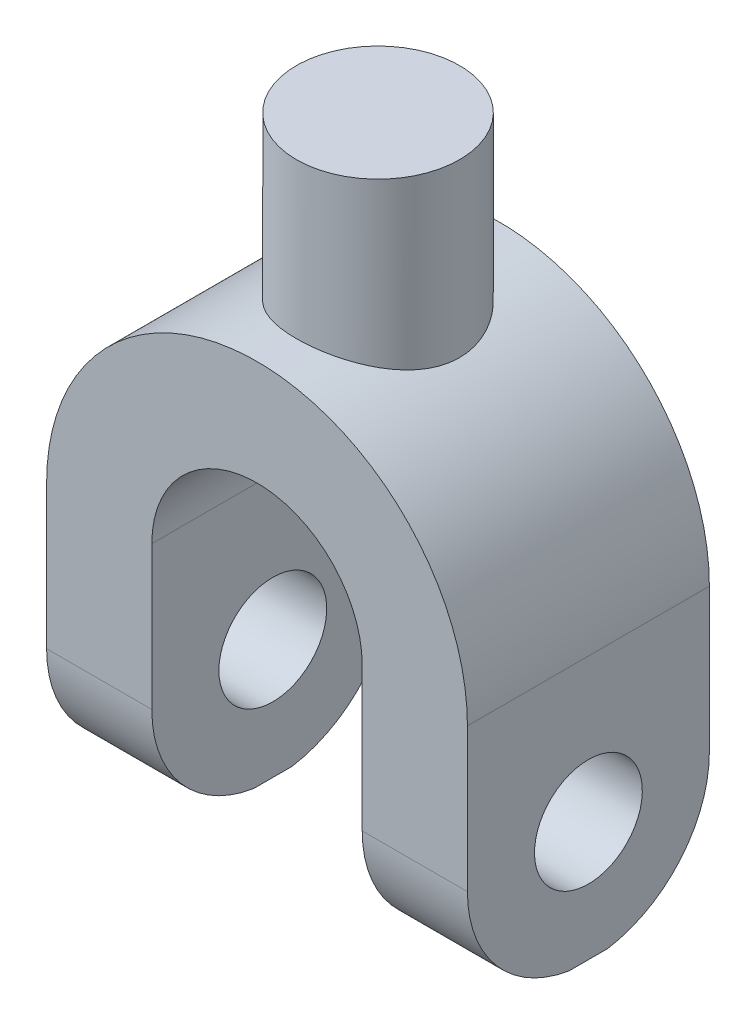
ISO-10303-21;
HEADER;
FILE_DESCRIPTION(('STEP AP214'),'2;1');
FILE_NAME('part.step','',(''),(''),'','','');
FILE_SCHEMA(('AUTOMOTIVE_DESIGN { 1 0 10303 214 1 1 1 1 }'));
ENDSEC;
DATA;
#1=APPLICATION_CONTEXT('core data for automotive mechanical design processes');
#2=APPLICATION_PROTOCOL_DEFINITION('international standard','automotive_design',2000,#1);
#3=PRODUCT_CONTEXT('',#1,'mechanical');
#4=PRODUCT('Part','Part','',(#3));
#5=PRODUCT_RELATED_PRODUCT_CATEGORY('part','',(#4));
#6=PRODUCT_DEFINITION_FORMATION('','',#4);
#7=PRODUCT_DEFINITION_CONTEXT('part definition',#1,'design');
#8=PRODUCT_DEFINITION('design','',#6,#7);
#9=PRODUCT_DEFINITION_SHAPE('','',#8);
#10=(LENGTH_UNIT() NAMED_UNIT(*) SI_UNIT(.MILLI.,.METRE.));
#11=(NAMED_UNIT(*) PLANE_ANGLE_UNIT() SI_UNIT($,.RADIAN.));
#12=(NAMED_UNIT(*) SI_UNIT($,.STERADIAN.) SOLID_ANGLE_UNIT());
#13=UNCERTAINTY_MEASURE_WITH_UNIT(LENGTH_MEASURE(1.E-05),#10,'distance_accuracy_value','');
#14=(GEOMETRIC_REPRESENTATION_CONTEXT(3) GLOBAL_UNCERTAINTY_ASSIGNED_CONTEXT((#13)) GLOBAL_UNIT_ASSIGNED_CONTEXT((#10,
#11,#12)) REPRESENTATION_CONTEXT('',''));
#15=CARTESIAN_POINT('',(0.,0.,0.));
#16=DIRECTION('',(0.,0.,1.));
#17=DIRECTION('',(1.,0.,0.));
#18=AXIS2_PLACEMENT_3D('',#15,#16,#17);
#19=CARTESIAN_POINT('',(-152.609053497942,0.,29.21));
#20=DIRECTION('',(1.,0.,0.));
#21=DIRECTION('',(0.,0.,-1.));
#22=AXIS2_PLACEMENT_3D('',#19,#20,#21);
#23=PLANE('',#22);
#24=CARTESIAN_POINT('',(-152.609053497942,-27.3983473015084,0.));
#25=DIRECTION('',(1.,0.,0.));
#26=DIRECTION('',(0.,1.,0.));
#27=AXIS2_PLACEMENT_3D('',#24,#25,#26);
#28=CIRCLE('',#27,13.0169015433458);
#29=CARTESIAN_POINT('',(-152.609053497942,-14.3814457581626,0.));
#30=VERTEX_POINT('',#29);
#31=EDGE_CURVE('E269',#30,#30,#28,.T.);
#32=ORIENTED_EDGE('',*,*,#31,.T.);
#33=EDGE_LOOP('',(#32));
#34=FACE_BOUND('',#33,.T.);
#35=CARTESIAN_POINT('',(-152.609053497942,-27.3983473015084,0.));
#36=DIRECTION('',(1.,0.,0.));
#37=DIRECTION('',(0.,1.,0.));
#38=AXIS2_PLACEMENT_3D('',#35,#36,#37);
#39=CIRCLE('',#38,29.21);
#40=CARTESIAN_POINT('',(-152.609053497942,-56.235390946502,-4.65285007460321));
#41=VERTEX_POINT('',#40);
#42=CARTESIAN_POINT('',(-152.609053497942,-27.3983473015084,-29.21));
#43=VERTEX_POINT('',#42);
#44=EDGE_CURVE('E322',#41,#43,#39,.T.);
#45=ORIENTED_EDGE('',*,*,#44,.F.);
#46=DIRECTION('',(0.,0.,-1.));
#47=VECTOR('',#46,1.);
#48=CARTESIAN_POINT('',(-152.609053497942,-56.235390946502,29.21));
#49=LINE('',#48,#47);
#50=CARTESIAN_POINT('',(-152.609053497942,-56.235390946502,4.65285007460321));
#51=VERTEX_POINT('',#50);
#52=EDGE_CURVE('E160',#51,#41,#49,.T.);
#53=ORIENTED_EDGE('',*,*,#52,.F.);
#54=CARTESIAN_POINT('',(-152.609053497942,-27.3983473015084,0.));
#55=DIRECTION('',(1.,0.,0.));
#56=DIRECTION('',(0.,1.,0.));
#57=AXIS2_PLACEMENT_3D('',#54,#55,#56);
#58=CIRCLE('',#57,29.21);
#59=CARTESIAN_POINT('',(-152.609053497942,-27.3983473015084,29.21));
#60=VERTEX_POINT('',#59);
#61=EDGE_CURVE('E146',#60,#51,#58,.T.);
#62=ORIENTED_EDGE('',*,*,#61,.F.);
#63=DIRECTION('',(0.,-1.,0.));
#64=VECTOR('',#63,1.);
#65=CARTESIAN_POINT('',(-152.609053497942,0.,29.21));
#66=LINE('',#65,#64);
#67=CARTESIAN_POINT('',(-152.609053497942,7.26460905349796,29.21));
#68=VERTEX_POINT('',#67);
#69=EDGE_CURVE('E157',#68,#60,#66,.T.);
#70=ORIENTED_EDGE('',*,*,#69,.F.);
#71=DIRECTION('',(0.,0.,-1.));
#72=VECTOR('',#71,1.);
#73=CARTESIAN_POINT('',(-152.609053497942,7.26460905349796,29.21));
#74=LINE('',#73,#72);
#75=CARTESIAN_POINT('',(-152.609053497942,7.26460905349796,-29.21));
#76=VERTEX_POINT('',#75);
#77=EDGE_CURVE('E213',#68,#76,#74,.T.);
#78=ORIENTED_EDGE('',*,*,#77,.T.);
#79=DIRECTION('',(0.,-1.,0.));
#80=VECTOR('',#79,1.);
#81=CARTESIAN_POINT('',(-152.609053497942,0.,-29.21));
#82=LINE('',#81,#80);
#83=EDGE_CURVE('E183',#76,#43,#82,.T.);
#84=ORIENTED_EDGE('',*,*,#83,.T.);
#85=EDGE_LOOP('',(#45,#53,#62,#70,#78,#84));
#86=FACE_BOUND('',#85,.T.);
#87=ADVANCED_FACE('F57',(#34,#86),#23,.F.);
#88=CARTESIAN_POINT('',(0.,-56.235390946502,29.21));
#89=DIRECTION('',(0.,1.,0.));
#90=DIRECTION('',(0.,0.,1.));
#91=AXIS2_PLACEMENT_3D('',#88,#89,#90);
#92=PLANE('',#91);
#93=DIRECTION('',(1.,0.,0.));
#94=VECTOR('',#93,1.);
#95=CARTESIAN_POINT('',(-152.609053497942,-56.235390946502,-4.65285007460321));
#96=LINE('',#95,#94);
#97=CARTESIAN_POINT('',(-127.209053497942,-56.235390946502,-4.65285007460321));
#98=VERTEX_POINT('',#97);
#99=EDGE_CURVE('E281',#41,#98,#96,.T.);
#100=ORIENTED_EDGE('',*,*,#99,.T.);
#101=DIRECTION('',(0.,0.,-1.));
#102=VECTOR('',#101,1.);
#103=CARTESIAN_POINT('',(-127.209053497942,-56.235390946502,29.21));
#104=LINE('',#103,#102);
#105=CARTESIAN_POINT('',(-127.209053497942,-56.235390946502,4.65285007460321));
#106=VERTEX_POINT('',#105);
#107=EDGE_CURVE('E209',#106,#98,#104,.T.);
#108=ORIENTED_EDGE('',*,*,#107,.F.);
#109=DIRECTION('',(1.,0.,0.));
#110=VECTOR('',#109,1.);
#111=CARTESIAN_POINT('',(-152.609053497942,-56.235390946502,4.65285007460321));
#112=LINE('',#111,#110);
#113=EDGE_CURVE('E278',#51,#106,#112,.T.);
#114=ORIENTED_EDGE('',*,*,#113,.F.);
#115=ORIENTED_EDGE('',*,*,#52,.T.);
#116=EDGE_LOOP('',(#100,#108,#114,#115));
#117=FACE_BOUND('',#116,.T.);
#118=ADVANCED_FACE('F259',(#117),#92,.F.);
#119=CARTESIAN_POINT('',(-127.209053497942,0.,29.21));
#120=DIRECTION('',(-1.,0.,0.));
#121=DIRECTION('',(0.,0.,1.));
#122=AXIS2_PLACEMENT_3D('',#119,#120,#121);
#123=PLANE('',#122);
#124=CARTESIAN_POINT('',(-127.209053497942,-27.3983473015084,0.));
#125=DIRECTION('',(-1.,0.,0.));
#126=DIRECTION('',(0.,0.,1.));
#127=AXIS2_PLACEMENT_3D('',#124,#125,#126);
#128=CIRCLE('',#127,13.0169015433458);
#129=CARTESIAN_POINT('',(-127.209053497942,-27.3983473015084,13.0169015433458));
#130=VERTEX_POINT('',#129);
#131=EDGE_CURVE('E292',#130,#130,#128,.T.);
#132=ORIENTED_EDGE('',*,*,#131,.T.);
#133=EDGE_LOOP('',(#132));
#134=FACE_BOUND('',#133,.T.);
#135=CARTESIAN_POINT('',(-127.209053497942,-27.3983473015084,0.));
#136=DIRECTION('',(-1.,0.,0.));
#137=DIRECTION('',(0.,0.,1.));
#138=AXIS2_PLACEMENT_3D('',#135,#136,#137);
#139=CIRCLE('',#138,29.21);
#140=CARTESIAN_POINT('',(-127.209053497942,-27.3983473015084,-29.21));
#141=VERTEX_POINT('',#140);
#142=EDGE_CURVE('E275',#141,#98,#139,.T.);
#143=ORIENTED_EDGE('',*,*,#142,.F.);
#144=DIRECTION('',(0.,1.,0.));
#145=VECTOR('',#144,1.);
#146=CARTESIAN_POINT('',(-127.209053497942,0.,-29.21));
#147=LINE('',#146,#145);
#148=CARTESIAN_POINT('',(-127.209053497942,7.26460905349796,-29.21));
#149=VERTEX_POINT('',#148);
#150=EDGE_CURVE('E187',#141,#149,#147,.T.);
#151=ORIENTED_EDGE('',*,*,#150,.T.);
#152=DIRECTION('',(0.,0.,-1.));
#153=VECTOR('',#152,1.);
#154=CARTESIAN_POINT('',(-127.209053497942,7.26460905349796,29.21));
#155=LINE('',#154,#153);
#156=CARTESIAN_POINT('',(-127.209053497942,7.26460905349796,29.21));
#157=VERTEX_POINT('',#156);
#158=EDGE_CURVE('E206',#157,#149,#155,.T.);
#159=ORIENTED_EDGE('',*,*,#158,.F.);
#160=DIRECTION('',(0.,1.,0.));
#161=VECTOR('',#160,1.);
#162=CARTESIAN_POINT('',(-127.209053497942,0.,29.21));
#163=LINE('',#162,#161);
#164=CARTESIAN_POINT('',(-127.209053497942,-27.3983473015084,29.21));
#165=VERTEX_POINT('',#164);
#166=EDGE_CURVE('E165',#165,#157,#163,.T.);
#167=ORIENTED_EDGE('',*,*,#166,.F.);
#168=CARTESIAN_POINT('',(-127.209053497942,-27.3983473015084,0.));
#169=DIRECTION('',(-1.,0.,0.));
#170=DIRECTION('',(0.,0.,1.));
#171=AXIS2_PLACEMENT_3D('',#168,#169,#170);
#172=CIRCLE('',#171,29.21);
#173=EDGE_CURVE('E80',#106,#165,#172,.T.);
#174=ORIENTED_EDGE('',*,*,#173,.F.);
#175=ORIENTED_EDGE('',*,*,#107,.T.);
#176=EDGE_LOOP('',(#143,#151,#159,#167,#174,#175));
#177=FACE_BOUND('',#176,.T.);
#178=ADVANCED_FACE('F252',(#134,#177),#123,.F.);
#179=CARTESIAN_POINT('',(-76.4090534979423,0.,29.21));
#180=DIRECTION('',(-1.,0.,0.));
#181=DIRECTION('',(0.,0.,1.));
#182=AXIS2_PLACEMENT_3D('',#179,#180,#181);
#183=PLANE('',#182);
#184=CARTESIAN_POINT('',(-76.4090534979423,-27.3983473015084,0.));
#185=DIRECTION('',(-1.,0.,0.));
#186=DIRECTION('',(0.,0.,1.));
#187=AXIS2_PLACEMENT_3D('',#184,#185,#186);
#188=CIRCLE('',#187,13.0169015433458);
#189=CARTESIAN_POINT('',(-76.4090534979423,-27.3983473015084,13.0169015433458));
#190=VERTEX_POINT('',#189);
#191=EDGE_CURVE('E289',#190,#190,#188,.T.);
#192=ORIENTED_EDGE('',*,*,#191,.F.);
#193=EDGE_LOOP('',(#192));
#194=FACE_BOUND('',#193,.T.);
#195=DIRECTION('',(0.,1.,0.));
#196=VECTOR('',#195,1.);
#197=CARTESIAN_POINT('',(-76.4090534979423,0.,-29.21));
#198=LINE('',#197,#196);
#199=CARTESIAN_POINT('',(-76.4090534979423,-27.3983473015084,-29.21));
#200=VERTEX_POINT('',#199);
#201=CARTESIAN_POINT('',(-76.4090534979423,7.26460905349796,-29.21));
#202=VERTEX_POINT('',#201);
#203=EDGE_CURVE('E192',#200,#202,#198,.T.);
#204=ORIENTED_EDGE('',*,*,#203,.F.);
#205=CARTESIAN_POINT('',(-76.4090534979423,-27.3983473015084,0.));
#206=DIRECTION('',(-1.,0.,0.));
#207=DIRECTION('',(0.,0.,1.));
#208=AXIS2_PLACEMENT_3D('',#205,#206,#207);
#209=CIRCLE('',#208,29.21);
#210=CARTESIAN_POINT('',(-76.4090534979423,-56.235390946502,-4.65285007460321));
#211=VERTEX_POINT('',#210);
#212=EDGE_CURVE('E271',#200,#211,#209,.T.);
#213=ORIENTED_EDGE('',*,*,#212,.T.);
#214=DIRECTION('',(0.,0.,-1.));
#215=VECTOR('',#214,1.);
#216=CARTESIAN_POINT('',(-76.4090534979423,-56.235390946502,29.21));
#217=LINE('',#216,#215);
#218=CARTESIAN_POINT('',(-76.4090534979423,-56.235390946502,4.65285007460321));
#219=VERTEX_POINT('',#218);
#220=EDGE_CURVE('E200',#219,#211,#217,.T.);
#221=ORIENTED_EDGE('',*,*,#220,.F.);
#222=CARTESIAN_POINT('',(-76.4090534979423,-27.3983473015084,0.));
#223=DIRECTION('',(-1.,0.,0.));
#224=DIRECTION('',(0.,0.,1.));
#225=AXIS2_PLACEMENT_3D('',#222,#223,#224);
#226=CIRCLE('',#225,29.21);
#227=CARTESIAN_POINT('',(-76.4090534979423,-27.3983473015084,29.21));
#228=VERTEX_POINT('',#227);
#229=EDGE_CURVE('E285',#219,#228,#226,.T.);
#230=ORIENTED_EDGE('',*,*,#229,.T.);
#231=DIRECTION('',(0.,1.,0.));
#232=VECTOR('',#231,1.);
#233=CARTESIAN_POINT('',(-76.4090534979423,0.,29.21));
#234=LINE('',#233,#232);
#235=CARTESIAN_POINT('',(-76.4090534979423,7.26460905349796,29.21));
#236=VERTEX_POINT('',#235);
#237=EDGE_CURVE('E175',#228,#236,#234,.T.);
#238=ORIENTED_EDGE('',*,*,#237,.T.);
#239=DIRECTION('',(0.,0.,-1.));
#240=VECTOR('',#239,1.);
#241=CARTESIAN_POINT('',(-76.4090534979423,7.26460905349796,29.21));
#242=LINE('',#241,#240);
#243=EDGE_CURVE('E203',#236,#202,#242,.T.);
#244=ORIENTED_EDGE('',*,*,#243,.T.);
#245=EDGE_LOOP('',(#204,#213,#221,#230,#238,#244));
#246=FACE_BOUND('',#245,.T.);
#247=ADVANCED_FACE('F248',(#194,#246),#183,.T.);
#248=CARTESIAN_POINT('',(0.,-56.235390946502,29.21));
#249=DIRECTION('',(0.,1.,0.));
#250=DIRECTION('',(0.,0.,1.));
#251=AXIS2_PLACEMENT_3D('',#248,#249,#250);
#252=PLANE('',#251);
#253=CARTESIAN_POINT('',(-51.0090534979424,-56.235390946502,-4.65285007460321));
#254=VERTEX_POINT('',#253);
#255=EDGE_CURVE('E336',#211,#254,#96,.T.);
#256=ORIENTED_EDGE('',*,*,#255,.T.);
#257=DIRECTION('',(0.,0.,-1.));
#258=VECTOR('',#257,1.);
#259=CARTESIAN_POINT('',(-51.0090534979424,-56.235390946502,29.21));
#260=LINE('',#259,#258);
#261=CARTESIAN_POINT('',(-51.0090534979424,-56.235390946502,4.65285007460321));
#262=VERTEX_POINT('',#261);
#263=EDGE_CURVE('E197',#262,#254,#260,.T.);
#264=ORIENTED_EDGE('',*,*,#263,.F.);
#265=EDGE_CURVE('E151',#219,#262,#112,.T.);
#266=ORIENTED_EDGE('',*,*,#265,.F.);
#267=ORIENTED_EDGE('',*,*,#220,.T.);
#268=EDGE_LOOP('',(#256,#264,#266,#267));
#269=FACE_BOUND('',#268,.T.);
#270=ADVANCED_FACE('F244',(#269),#252,.F.);
#271=CARTESIAN_POINT('',(-51.0090534979423,0.,29.21));
#272=DIRECTION('',(-1.,0.,0.));
#273=DIRECTION('',(0.,-1.,0.));
#274=AXIS2_PLACEMENT_3D('',#271,#272,#273);
#275=PLANE('',#274);
#276=CARTESIAN_POINT('',(-51.0090534979423,-27.3983473015085,0.));
#277=DIRECTION('',(1.,0.,0.));
#278=DIRECTION('',(0.,1.,0.));
#279=AXIS2_PLACEMENT_3D('',#276,#277,#278);
#280=CIRCLE('',#279,13.0169015433458);
#281=CARTESIAN_POINT('',(-51.0090534979423,-14.3814457581626,0.));
#282=VERTEX_POINT('',#281);
#283=EDGE_CURVE('E272',#282,#282,#280,.T.);
#284=ORIENTED_EDGE('',*,*,#283,.F.);
#285=EDGE_LOOP('',(#284));
#286=FACE_BOUND('',#285,.T.);
#287=CARTESIAN_POINT('',(-51.0090534979423,-27.3983473015085,0.));
#288=DIRECTION('',(1.,0.,0.));
#289=DIRECTION('',(0.,1.,0.));
#290=AXIS2_PLACEMENT_3D('',#287,#288,#289);
#291=CIRCLE('',#290,29.21);
#292=CARTESIAN_POINT('',(-51.0090534979423,-27.3983473015085,-29.21));
#293=VERTEX_POINT('',#292);
#294=EDGE_CURVE('E316',#254,#293,#291,.T.);
#295=ORIENTED_EDGE('',*,*,#294,.T.);
#296=DIRECTION('',(0.,1.,0.));
#297=VECTOR('',#296,1.);
#298=CARTESIAN_POINT('',(-51.0090534979423,0.,-29.21));
#299=LINE('',#298,#297);
#300=CARTESIAN_POINT('',(-51.0090534979423,7.26460905349796,-29.21));
#301=VERTEX_POINT('',#300);
#302=EDGE_CURVE('E169',#293,#301,#299,.T.);
#303=ORIENTED_EDGE('',*,*,#302,.T.);
#304=DIRECTION('',(0.,0.,-1.));
#305=VECTOR('',#304,1.);
#306=CARTESIAN_POINT('',(-51.0090534979423,7.26460905349796,29.21));
#307=LINE('',#306,#305);
#308=CARTESIAN_POINT('',(-51.0090534979423,7.26460905349796,29.21));
#309=VERTEX_POINT('',#308);
#310=EDGE_CURVE('E179',#309,#301,#307,.T.);
#311=ORIENTED_EDGE('',*,*,#310,.F.);
#312=DIRECTION('',(0.,1.,0.));
#313=VECTOR('',#312,1.);
#314=CARTESIAN_POINT('',(-51.0090534979423,0.,29.21));
#315=LINE('',#314,#313);
#316=CARTESIAN_POINT('',(-51.0090534979423,-27.3983473015085,29.21));
#317=VERTEX_POINT('',#316);
#318=EDGE_CURVE('E177',#317,#309,#315,.T.);
#319=ORIENTED_EDGE('',*,*,#318,.F.);
#320=CARTESIAN_POINT('',(-51.0090534979423,-27.3983473015085,0.));
#321=DIRECTION('',(1.,0.,0.));
#322=DIRECTION('',(0.,1.,0.));
#323=AXIS2_PLACEMENT_3D('',#320,#321,#322);
#324=CIRCLE('',#323,29.21);
#325=EDGE_CURVE('E73',#317,#262,#324,.T.);
#326=ORIENTED_EDGE('',*,*,#325,.T.);
#327=ORIENTED_EDGE('',*,*,#263,.T.);
#328=EDGE_LOOP('',(#295,#303,#311,#319,#326,#327));
#329=FACE_BOUND('',#328,.T.);
#330=ADVANCED_FACE('F238',(#286,#329),#275,.F.);
#331=CARTESIAN_POINT('',(0.,0.,29.21));
#332=DIRECTION('',(0.,0.,1.));
#333=DIRECTION('',(1.,0.,0.));
#334=AXIS2_PLACEMENT_3D('',#331,#332,#333);
#335=PLANE('',#334);
#336=ORIENTED_EDGE('',*,*,#69,.T.);
#337=DIRECTION('',(1.,0.,0.));
#338=VECTOR('',#337,1.);
#339=CARTESIAN_POINT('',(-152.609053497942,-27.3983473015084,29.21));
#340=LINE('',#339,#338);
#341=EDGE_CURVE('E143',#60,#165,#340,.T.);
#342=ORIENTED_EDGE('',*,*,#341,.T.);
#343=ORIENTED_EDGE('',*,*,#166,.T.);
#344=CARTESIAN_POINT('',(-101.809053497942,7.26460905349796,29.21));
#345=DIRECTION('',(0.,0.,1.));
#346=DIRECTION('',(1.,0.,0.));
#347=AXIS2_PLACEMENT_3D('',#344,#345,#346);
#348=CIRCLE('',#347,25.4);
#349=EDGE_CURVE('E167',#157,#236,#348,.F.);
#350=ORIENTED_EDGE('',*,*,#349,.T.);
#351=ORIENTED_EDGE('',*,*,#237,.F.);
#352=DIRECTION('',(1.,0.,0.));
#353=VECTOR('',#352,1.);
#354=CARTESIAN_POINT('',(-152.609053497942,-27.3983473015084,29.21));
#355=LINE('',#354,#353);
#356=EDGE_CURVE('E12',#228,#317,#355,.T.);
#357=ORIENTED_EDGE('',*,*,#356,.T.);
#358=ORIENTED_EDGE('',*,*,#318,.T.);
#359=CARTESIAN_POINT('',(-101.809053497942,7.26460905349796,29.21));
#360=DIRECTION('',(0.,0.,1.));
#361=DIRECTION('',(1.,0.,0.));
#362=AXIS2_PLACEMENT_3D('',#359,#360,#361);
#363=CIRCLE('',#362,50.8);
#364=EDGE_CURVE('E164',#68,#309,#363,.F.);
#365=ORIENTED_EDGE('',*,*,#364,.F.);
#366=EDGE_LOOP('',(#336,#342,#343,#350,#351,#357,#358,#365));
#367=FACE_BOUND('',#366,.T.);
#368=ADVANCED_FACE('F162',(#367),#335,.T.);
#369=CARTESIAN_POINT('',(0.,0.,-29.21));
#370=DIRECTION('',(0.,0.,1.));
#371=DIRECTION('',(1.,0.,0.));
#372=AXIS2_PLACEMENT_3D('',#369,#370,#371);
#373=PLANE('',#372);
#374=DIRECTION('',(1.,0.,0.));
#375=VECTOR('',#374,1.);
#376=CARTESIAN_POINT('',(-152.609053497942,-27.3983473015084,-29.21));
#377=LINE('',#376,#375);
#378=EDGE_CURVE('E340',#43,#141,#377,.T.);
#379=ORIENTED_EDGE('',*,*,#378,.F.);
#380=ORIENTED_EDGE('',*,*,#83,.F.);
#381=CARTESIAN_POINT('',(-101.809053497942,7.26460905349796,-29.21));
#382=DIRECTION('',(0.,0.,1.));
#383=DIRECTION('',(1.,0.,0.));
#384=AXIS2_PLACEMENT_3D('',#381,#382,#383);
#385=CIRCLE('',#384,50.8);
#386=EDGE_CURVE('E180',#76,#301,#385,.F.);
#387=ORIENTED_EDGE('',*,*,#386,.T.);
#388=ORIENTED_EDGE('',*,*,#302,.F.);
#389=DIRECTION('',(1.,0.,0.));
#390=VECTOR('',#389,1.);
#391=CARTESIAN_POINT('',(-152.609053497942,-27.3983473015084,-29.21));
#392=LINE('',#391,#390);
#393=EDGE_CURVE('E66',#200,#293,#392,.T.);
#394=ORIENTED_EDGE('',*,*,#393,.F.);
#395=ORIENTED_EDGE('',*,*,#203,.T.);
#396=CARTESIAN_POINT('',(-101.809053497942,7.26460905349796,-29.21));
#397=DIRECTION('',(0.,0.,1.));
#398=DIRECTION('',(1.,0.,0.));
#399=AXIS2_PLACEMENT_3D('',#396,#397,#398);
#400=CIRCLE('',#399,25.4);
#401=EDGE_CURVE('E189',#149,#202,#400,.F.);
#402=ORIENTED_EDGE('',*,*,#401,.F.);
#403=ORIENTED_EDGE('',*,*,#150,.F.);
#404=EDGE_LOOP('',(#379,#380,#387,#388,#394,#395,#402,#403));
#405=FACE_BOUND('',#404,.T.);
#406=ADVANCED_FACE('F237',(#405),#373,.F.);
#407=CARTESIAN_POINT('',(-101.809053497942,7.26460905349796,29.21));
#408=DIRECTION('',(0.,0.,-1.));
#409=DIRECTION('',(-1.,0.,0.));
#410=AXIS2_PLACEMENT_3D('',#407,#408,#409);
#411=CYLINDRICAL_SURFACE('',#410,50.8);
#412=ORIENTED_EDGE('',*,*,#386,.F.);
#413=ORIENTED_EDGE('',*,*,#77,.F.);
#414=ORIENTED_EDGE('',*,*,#364,.T.);
#415=ORIENTED_EDGE('',*,*,#310,.T.);
#416=EDGE_LOOP('',(#412,#413,#414,#415));
#417=FACE_BOUND('',#416,.T.);
#418=CARTESIAN_POINT('',(-101.809053497942,58.064609053498,19.6930949171975));
#419=CARTESIAN_POINT('',(-102.340980770365,58.0646115698917,19.6930982786585));
#420=CARTESIAN_POINT('',(-102.872863391504,58.0562367826779,19.6715271935733));
#421=CARTESIAN_POINT('',(-103.932584792658,58.0229732306218,19.5854824459213));
#422=CARTESIAN_POINT('',(-104.460424012044,57.9980862865575,19.521013513652));
#423=CARTESIAN_POINT('',(-105.508077663399,57.9324754379461,19.3498552326294));
#424=CARTESIAN_POINT('',(-106.027893792055,57.8917549308741,19.2431749412607));
#425=CARTESIAN_POINT('',(-107.055953139802,57.7955561171556,18.9886405680291));
#426=CARTESIAN_POINT('',(-107.564195976733,57.7400773239425,18.8407851286534));
#427=CARTESIAN_POINT('',(-108.564633026344,57.6159320431117,18.5056174511092));
#428=CARTESIAN_POINT('',(-109.056858323072,57.5472931313561,18.3183876403601));
#429=CARTESIAN_POINT('',(-110.02326760142,57.3984872084275,17.9058848895641));
#430=CARTESIAN_POINT('',(-110.497451749793,57.3183203038396,17.6806123012488));
#431=CARTESIAN_POINT('',(-111.425104349038,57.1484139983212,17.1937205633058));
#432=CARTESIAN_POINT('',(-111.878568166628,57.0586724712214,16.9320933367422));
#433=CARTESIAN_POINT('',(-112.762173909271,56.8717972088576,16.3743739626468));
#434=CARTESIAN_POINT('',(-113.192315074043,56.7746632328591,16.078280692565));
#435=CARTESIAN_POINT('',(-114.043816107547,56.5713005831376,15.440940798547));
#436=CARTESIAN_POINT('',(-114.464124931115,56.4648631891612,15.0983560772575));
#437=CARTESIAN_POINT('',(-115.274875027593,56.2491752868654,14.379956299357));
#438=CARTESIAN_POINT('',(-115.665302552561,56.1399235142225,14.0041261164003));
#439=CARTESIAN_POINT('',(-116.414009102598,55.9214422648378,13.2214460364139));
#440=CARTESIAN_POINT('',(-116.772277547587,55.8122128071436,12.814586011648));
#441=CARTESIAN_POINT('',(-117.454256091326,55.5967463112611,11.9724301088726));
#442=CARTESIAN_POINT('',(-117.777981222636,55.4905079863314,11.537146734171));
#443=CARTESIAN_POINT('',(-118.401720875709,55.2795679058546,10.6217111193631));
#444=CARTESIAN_POINT('',(-118.700188156346,55.1751140573828,10.1404455067893));
#445=CARTESIAN_POINT('',(-119.255309363536,54.9757732047187,9.1524433819463));
#446=CARTESIAN_POINT('',(-119.511961846628,54.8808865308316,8.64570599117229));
#447=CARTESIAN_POINT('',(-119.981148482727,54.7038108280061,7.61024939590851));
#448=CARTESIAN_POINT('',(-120.193697473171,54.6216175311089,7.0815376561832));
#449=CARTESIAN_POINT('',(-120.572700774847,54.4727339869875,6.00572358233141));
#450=CARTESIAN_POINT('',(-120.739158000867,54.4060427594741,5.45862241358499));
#451=CARTESIAN_POINT('',(-121.018017847621,54.2930828025416,4.37417916877285));
#452=CARTESIAN_POINT('',(-121.132445110723,54.246056234059,3.83743664732433));
#453=CARTESIAN_POINT('',(-121.316210689375,54.1700538205602,2.75501579747448));
#454=CARTESIAN_POINT('',(-121.385550232926,54.1410774839325,2.20933771285542));
#455=CARTESIAN_POINT('',(-121.478319190695,54.1022277789231,1.11362499805567));
#456=CARTESIAN_POINT('',(-121.501766382403,54.0923470134378,0.563592137736513));
#457=CARTESIAN_POINT('',(-121.502521129378,54.0920299714024,-0.536498909198987));
#458=CARTESIAN_POINT('',(-121.479830650319,54.1015928664637,-1.08655709373799));
#459=CARTESIAN_POINT('',(-121.39155008784,54.1385665504966,-2.14666255632285));
#460=CARTESIAN_POINT('',(-121.328833283243,54.1647814295023,-2.65699411598842));
#461=CARTESIAN_POINT('',(-121.163936445655,54.2330714678586,-3.67013375273247));
#462=CARTESIAN_POINT('',(-121.061758374744,54.2751458386468,-4.17294220258136));
#463=CARTESIAN_POINT('',(-120.818906754603,54.3738717001145,-5.16775342263859));
#464=CARTESIAN_POINT('',(-120.6782288131,54.4305248539758,-5.65975495301289));
#465=CARTESIAN_POINT('',(-120.359629353789,54.5567380258514,-6.62984113362931));
#466=CARTESIAN_POINT('',(-120.181706548092,54.6262984901768,-7.10792530197296));
#467=CARTESIAN_POINT('',(-119.786204750716,54.7778464575365,-8.05663130520746));
#468=CARTESIAN_POINT('',(-119.567915307231,54.8600512656447,-8.52692198032538));
#469=CARTESIAN_POINT('',(-119.095755938028,55.033564949058,-9.44751475950625));
#470=CARTESIAN_POINT('',(-118.841885841807,55.1248738679896,-9.8978167677694));
#471=CARTESIAN_POINT('',(-118.300195651662,55.3142140851054,-10.7762027635488));
#472=CARTESIAN_POINT('',(-118.012365678718,55.4122473359265,-11.2042802334779));
#473=CARTESIAN_POINT('',(-117.404556498229,55.6125424471549,-12.0359285167523));
#474=CARTESIAN_POINT('',(-117.084575734963,55.7148045120461,-12.4394981426882));
#475=CARTESIAN_POINT('',(-116.39000477393,55.9285301061839,-13.2483261754096));
#476=CARTESIAN_POINT('',(-116.013139207576,56.0401245225118,-13.6515988783417));
#477=CARTESIAN_POINT('',(-115.22673728681,56.2622895523497,-14.4252563487777));
#478=CARTESIAN_POINT('',(-114.817199424224,56.3728601183349,-14.795639596415));
#479=CARTESIAN_POINT('',(-113.967755031971,56.590040175793,-15.5012536203515));
#480=CARTESIAN_POINT('',(-113.527842950932,56.6966489376772,-15.8364779424462));
#481=CARTESIAN_POINT('',(-112.620285514776,56.9030397070617,-16.4694051477969));
#482=CARTESIAN_POINT('',(-112.152640316427,57.0028217531451,-16.7671082431222));
#483=CARTESIAN_POINT('',(-111.183961801943,57.1945508592657,-17.3276566681151));
#484=CARTESIAN_POINT('',(-110.682485292276,57.2863288329604,-17.5897951575538));
#485=CARTESIAN_POINT('',(-109.657042945385,57.4574294947751,-18.0706313868036));
#486=CARTESIAN_POINT('',(-109.133076650381,57.5367519292092,-18.2893282418498));
#487=CARTESIAN_POINT('',(-108.06660072771,57.6806032447948,-18.6811044805901));
#488=CARTESIAN_POINT('',(-107.524098327515,57.7451378179682,-18.8542014200808));
#489=CARTESIAN_POINT('',(-106.42452568558,57.857521005025,-19.153065882838));
#490=CARTESIAN_POINT('',(-105.867456385955,57.9053706951499,-19.278836458885));
#491=CARTESIAN_POINT('',(-104.774903350398,57.9807458943623,-19.4759419652275));
#492=CARTESIAN_POINT('',(-104.239967287464,58.0092629696198,-19.5499402276888));
#493=CARTESIAN_POINT('',(-103.165197931628,58.0493508315204,-19.6537603589608));
#494=CARTESIAN_POINT('',(-102.625364823065,58.0609222534091,-19.6835838837604));
#495=CARTESIAN_POINT('',(-101.545097004832,58.0667943865242,-19.6987326278232));
#496=CARTESIAN_POINT('',(-101.00466244519,58.061098721698,-19.6840671842534));
#497=CARTESIAN_POINT('',(-99.9272837472406,58.032604025051,-19.6104170318484));
#498=CARTESIAN_POINT('',(-99.3903395492969,58.0098052862312,-19.5514330822546));
#499=CARTESIAN_POINT('',(-98.3463117764404,57.9490385180293,-19.3931548805792));
#500=CARTESIAN_POINT('',(-97.8389169945559,57.9117430288296,-19.2956450256647));
#501=CARTESIAN_POINT('',(-96.8345481205591,57.8229758260262,-19.0614316525211));
#502=CARTESIAN_POINT('',(-96.3375736646182,57.771504608262,-18.9247295051555));
#503=CARTESIAN_POINT('',(-95.3571940414213,57.6556519330713,-18.6133302458635));
#504=CARTESIAN_POINT('',(-94.8737899709999,57.5912694354883,-18.4386300726499));
#505=CARTESIAN_POINT('',(-93.9235063025793,57.4511496430054,-18.0526773745527));
#506=CARTESIAN_POINT('',(-93.456627264783,57.3754119636167,-17.8414236119199));
#507=CARTESIAN_POINT('',(-92.5283118668966,57.2119471711541,-17.3770882332062));
#508=CARTESIAN_POINT('',(-92.0674600568254,57.123928299146,-17.1229409707121));
#509=CARTESIAN_POINT('',(-91.1687175165727,56.9398915954622,-16.5794165534809));
#510=CARTESIAN_POINT('',(-90.7308271034854,56.8438736533674,-16.2900389123995));
#511=CARTESIAN_POINT('',(-89.8802872513128,56.6461361321829,-15.6779175330789));
#512=CARTESIAN_POINT('',(-89.4676419908905,56.5444156144947,-15.3551682947158));
#513=CARTESIAN_POINT('',(-88.6696870089628,56.3376873142876,-14.678178212749));
#514=CARTESIAN_POINT('',(-88.2843871183087,56.232678368914,-14.3239261457451));
#515=CARTESIAN_POINT('',(-87.5203272829932,56.0154005680263,-13.5631351549359));
#516=CARTESIAN_POINT('',(-87.1434494864602,55.9030847839452,-13.1547168741522));
#517=CARTESIAN_POINT('',(-86.425249570138,55.680721480991,-12.3071179413454));
#518=CARTESIAN_POINT('',(-86.0839294714371,55.5706740913376,-11.8679355430699));
#519=CARTESIAN_POINT('',(-85.4389852773748,55.3559435387447,-10.9612252896215));
#520=CARTESIAN_POINT('',(-85.1353739546434,55.2512622003945,-10.4936879094882));
#521=CARTESIAN_POINT('',(-84.5682946488932,55.0504512721263,-9.53336425161374));
#522=CARTESIAN_POINT('',(-84.3048105535164,54.9543182562713,-9.04058821477105));
#523=CARTESIAN_POINT('',(-83.8182655395652,54.7729186601824,-8.02911436182666));
#524=CARTESIAN_POINT('',(-83.5955027928969,54.6877334920371,-7.51025824953981));
#525=CARTESIAN_POINT('',(-83.1947770999475,54.5318809119373,-6.45337668335272));
#526=CARTESIAN_POINT('',(-83.0168146548753,54.4612136624053,-5.91535101506764));
#527=CARTESIAN_POINT('',(-82.7076344704315,54.3369319506467,-4.82441820876588));
#528=CARTESIAN_POINT('',(-82.5763902560333,54.2833078320007,-4.27151969082894));
#529=CARTESIAN_POINT('',(-82.3620200347812,54.1950511058315,-3.15498773091614));
#530=CARTESIAN_POINT('',(-82.2788903425175,54.1604170437447,-2.59135511455278));
#531=CARTESIAN_POINT('',(-82.1657518858865,54.1131325387105,-1.49681196482359));
#532=CARTESIAN_POINT('',(-82.1325068383105,54.0991438662376,-0.966291473281656));
#533=CARTESIAN_POINT('',(-82.1090297903166,54.0892740351885,0.0958572214212467));
#534=CARTESIAN_POINT('',(-82.1187957478388,54.0933920169516,0.627485370795448));
#535=CARTESIAN_POINT('',(-82.1812258468664,54.1195928823188,1.6877057780178));
#536=CARTESIAN_POINT('',(-82.2338855753245,54.1416739178267,2.21629834254281));
#537=CARTESIAN_POINT('',(-82.3815205383478,54.2030510306746,3.26651786482444));
#538=CARTESIAN_POINT('',(-82.4764956675071,54.2423470651328,3.7881448399287));
#539=CARTESIAN_POINT('',(-82.7037195541036,54.3352016969574,4.80259233059231));
#540=CARTESIAN_POINT('',(-82.8345486800966,54.3882134666939,5.29578230513904));
#541=CARTESIAN_POINT('',(-83.1335031315458,54.507488863416,6.26904775389773));
#542=CARTESIAN_POINT('',(-83.3016272862945,54.5737520744266,6.7491236392356));
#543=CARTESIAN_POINT('',(-83.6738245703047,54.7176727646378,7.69344448546876));
#544=CARTESIAN_POINT('',(-83.8779039830158,54.7953322350227,8.15768666235197));
#545=CARTESIAN_POINT('',(-84.3204935064408,54.9599546688367,9.06776335084192));
#546=CARTESIAN_POINT('',(-84.559006474354,55.0469184041522,9.51359633095358));
#547=CARTESIAN_POINT('',(-85.0828785757526,55.2328953153237,10.4084783249619));
#548=CARTESIAN_POINT('',(-85.3700907229019,55.3323079006966,10.8563600662752));
#549=CARTESIAN_POINT('',(-85.9791572663126,55.5363140782744,11.7266576257915));
#550=CARTESIAN_POINT('',(-86.3010126373507,55.6409078162198,12.1490727269028));
#551=CARTESIAN_POINT('',(-86.9775272763334,55.852585512508,12.9663133732086));
#552=CARTESIAN_POINT('',(-87.332196298989,55.9596702042238,13.3611306526028));
#553=CARTESIAN_POINT('',(-88.0722582073709,56.1735939931387,14.120895525817));
#554=CARTESIAN_POINT('',(-88.4576510763694,56.2804330904715,14.4858431358995));
#555=CARTESIAN_POINT('',(-89.2809085014763,56.4974981069889,15.2045925114176));
#556=CARTESIAN_POINT('',(-89.7205308834663,56.6075470963569,15.55643787287));
#557=CARTESIAN_POINT('',(-90.6293090197085,56.8213562806264,16.2218518258195));
#558=CARTESIAN_POINT('',(-91.0984655040832,56.925116319932,16.5354194704769));
#559=CARTESIAN_POINT('',(-92.0635210748045,57.1234825003792,17.1219584303298));
#560=CARTESIAN_POINT('',(-92.5594261418734,57.2180865810144,17.3949206148419));
#561=CARTESIAN_POINT('',(-93.5746429051034,57.3954380730197,17.897860044571));
#562=CARTESIAN_POINT('',(-94.0939555250245,57.4781850159181,18.127835591509));
#563=CARTESIAN_POINT('',(-95.1907887983249,57.6349095129995,18.5576977001444));
#564=CARTESIAN_POINT('',(-95.7697989749671,57.7078152289643,18.7541905837475));
#565=CARTESIAN_POINT('',(-96.945570090972,57.8347203447362,19.0928998632438));
#566=CARTESIAN_POINT('',(-97.5423324404621,57.8887182382438,19.2351119349148));
#567=CARTESIAN_POINT('',(-98.7477082954876,57.9758808815358,19.4633556660473));
#568=CARTESIAN_POINT('',(-99.3563157082269,58.0090560644835,19.5494154613122));
#569=CARTESIAN_POINT('',(-100.579653758759,58.0534170049624,19.6642787401318));
#570=CARTESIAN_POINT('',(-101.194383439832,58.0646061456721,19.6930910328518));
#571=CARTESIAN_POINT('',(-101.809053497942,58.064609053498,19.6930949171975));
#572=B_SPLINE_CURVE_WITH_KNOTS('',3,(#418,#419,#420,#421,#422,#423,#424,#425,#426,#427,#428,
#429,#430,#431,#432,#433,#434,#435,#436,#437,#438,#439,#440,#441,#442,#443,#444,#445,#446,#447,
#448,#449,#450,#451,#452,#453,#454,#455,#456,#457,#458,#459,#460,#461,#462,#463,#464,#465,#466,
#467,#468,#469,#470,#471,#472,#473,#474,#475,#476,#477,#478,#479,#480,#481,#482,#483,#484,#485,
#486,#487,#488,#489,#490,#491,#492,#493,#494,#495,#496,#497,#498,#499,#500,#501,#502,#503,#504,
#505,#506,#507,#508,#509,#510,#511,#512,#513,#514,#515,#516,#517,#518,#519,#520,#521,#522,#523,
#524,#525,#526,#527,#528,#529,#530,#531,#532,#533,#534,#535,#536,#537,#538,#539,#540,#541,#542,
#543,#544,#545,#546,#547,#548,#549,#550,#551,#552,#553,#554,#555,#556,#557,#558,#559,#560,#561,
#562,#563,#564,#565,#566,#567,#568,#569,#570,#571),.UNSPECIFIED.,.T.,.F.,(4,2,2,2,2,2,2,2,2,2,2,
2,2,2,2,2,2,2,2,2,2,2,2,2,2,2,2,2,2,2,2,2,2,2,2,2,2,2,2,2,2,2,2,2,2,2,2,2,2,2,2,2,2,2,2,2,2,2,2,
2,2,2,2,2,2,2,2,2,2,2,2,2,2,2,2,2,4),(0.,1.59520421955725,3.19023256687617,4.78491885087202,
6.37965771666744,7.97109076473012,9.5625090997099,11.1542815682293,12.7461058948711,
14.4020283720018,16.0587081908082,17.7159310616125,19.3724297753903,21.0978602253058,
22.823350225057,24.5482587854167,26.2730582397197,27.9233405947044,29.5735780010411,
31.2231760221635,32.8727037643692,34.4154102561045,35.9580400518119,37.5008459124338,
39.0437051304083,40.6168771747124,42.1900567579538,43.7636951169473,45.3374096582626,
47.0248545184488,48.712377317231,50.4002093582279,52.0880318592024,53.8056019873808,
55.5232070933002,57.2401499580726,58.956982052692,60.5772733194264,62.1975038443756,
63.817394345339,65.4372570958176,66.9895396615992,68.5417679384419,70.0941213159359,
71.6465272683043,73.2455554240373,74.8446056563527,76.4439198567306,78.0438061393991,
79.7427550688629,81.4418005134238,83.1414198942974,84.8403550143328,86.5512711947177,
88.2622065153316,89.9721707066381,91.6820039031261,93.2752227076003,94.8683658706643,
96.4613451468089,98.0543204549334,99.5915884193024,101.128808134975,102.666296758213,
104.203913031326,105.825947388786,107.448027398315,109.070591172247,110.693154062767,
112.412295725168,114.131479903738,115.851050081513,117.570688180231,119.415092671541,
121.259644064686,123.103270510982,124.946613240649),.UNSPECIFIED.);
#573=CARTESIAN_POINT('',(-101.809053497942,58.064609053498,19.6930949171975));
#574=VERTEX_POINT('',#573);
#575=EDGE_CURVE('E215',#574,#574,#572,.T.);
#576=ORIENTED_EDGE('',*,*,#575,.T.);
#577=EDGE_LOOP('',(#576));
#578=FACE_BOUND('',#577,.T.);
#579=ADVANCED_FACE('F59',(#417,#578),#411,.T.);
#580=CARTESIAN_POINT('',(-101.809053497942,7.26460905349796,29.21));
#581=DIRECTION('',(0.,0.,-1.));
#582=DIRECTION('',(-1.,0.,0.));
#583=AXIS2_PLACEMENT_3D('',#580,#581,#582);
#584=CYLINDRICAL_SURFACE('',#583,25.4);
#585=ORIENTED_EDGE('',*,*,#401,.T.);
#586=ORIENTED_EDGE('',*,*,#243,.F.);
#587=ORIENTED_EDGE('',*,*,#349,.F.);
#588=ORIENTED_EDGE('',*,*,#158,.T.);
#589=EDGE_LOOP('',(#585,#586,#587,#588));
#590=FACE_BOUND('',#589,.T.);
#591=ADVANCED_FACE('F233',(#590),#584,.F.);
#592=CARTESIAN_POINT('',(0.,95.4941775011114,0.));
#593=DIRECTION('',(0.,-1.,0.));
#594=DIRECTION('',(0.,0.,-1.));
#595=AXIS2_PLACEMENT_3D('',#592,#593,#594);
#596=PLANE('',#595);
#597=CARTESIAN_POINT('',(-101.809053497942,95.4941775011114,0.));
#598=DIRECTION('',(0.,1.,0.));
#599=DIRECTION('',(0.,0.,1.));
#600=AXIS2_PLACEMENT_3D('',#597,#598,#599);
#601=CIRCLE('',#600,19.6930949171975);
#602=CARTESIAN_POINT('',(-101.809053497942,95.4941775011114,19.6930949171975));
#603=VERTEX_POINT('',#602);
#604=EDGE_CURVE('E184',#603,#603,#601,.T.);
#605=ORIENTED_EDGE('',*,*,#604,.T.);
#606=EDGE_LOOP('',(#605));
#607=FACE_BOUND('',#606,.T.);
#608=ADVANCED_FACE('F227',(#607),#596,.F.);
#609=CARTESIAN_POINT('',(-101.809053497942,95.4941775011114,0.));
#610=DIRECTION('',(0.,1.,0.));
#611=DIRECTION('',(0.,0.,1.));
#612=AXIS2_PLACEMENT_3D('',#609,#610,#611);
#613=CYLINDRICAL_SURFACE('',#612,19.6930949171975);
#614=ORIENTED_EDGE('',*,*,#575,.F.);
#615=EDGE_LOOP('',(#614));
#616=FACE_BOUND('',#615,.T.);
#617=ORIENTED_EDGE('',*,*,#604,.F.);
#618=EDGE_LOOP('',(#617));
#619=FACE_BOUND('',#618,.T.);
#620=ADVANCED_FACE('F221',(#616,#619),#613,.T.);
#621=CARTESIAN_POINT('',(-152.609053497942,-27.3983473015084,0.));
#622=DIRECTION('',(1.,0.,0.));
#623=DIRECTION('',(0.,1.,0.));
#624=AXIS2_PLACEMENT_3D('',#621,#622,#623);
#625=CYLINDRICAL_SURFACE('',#624,29.21);
#626=ORIENTED_EDGE('',*,*,#393,.T.);
#627=ORIENTED_EDGE('',*,*,#294,.F.);
#628=ORIENTED_EDGE('',*,*,#255,.F.);
#629=ORIENTED_EDGE('',*,*,#212,.F.);
#630=EDGE_LOOP('',(#626,#627,#628,#629));
#631=FACE_BOUND('',#630,.T.);
#632=ADVANCED_FACE('F226',(#631),#625,.T.);
#633=ORIENTED_EDGE('',*,*,#142,.T.);
#634=ORIENTED_EDGE('',*,*,#99,.F.);
#635=ORIENTED_EDGE('',*,*,#44,.T.);
#636=ORIENTED_EDGE('',*,*,#378,.T.);
#637=EDGE_LOOP('',(#633,#634,#635,#636));
#638=FACE_BOUND('',#637,.T.);
#639=ADVANCED_FACE('F350',(#638),#625,.T.);
#640=CARTESIAN_POINT('',(-152.609053497942,-27.3983473015084,0.));
#641=DIRECTION('',(1.,0.,0.));
#642=DIRECTION('',(0.,1.,0.));
#643=AXIS2_PLACEMENT_3D('',#640,#641,#642);
#644=CYLINDRICAL_SURFACE('',#643,29.21);
#645=ORIENTED_EDGE('',*,*,#265,.T.);
#646=ORIENTED_EDGE('',*,*,#325,.F.);
#647=ORIENTED_EDGE('',*,*,#356,.F.);
#648=ORIENTED_EDGE('',*,*,#229,.F.);
#649=EDGE_LOOP('',(#645,#646,#647,#648));
#650=FACE_BOUND('',#649,.T.);
#651=ADVANCED_FACE('F309',(#650),#644,.T.);
#652=ORIENTED_EDGE('',*,*,#173,.T.);
#653=ORIENTED_EDGE('',*,*,#341,.F.);
#654=ORIENTED_EDGE('',*,*,#61,.T.);
#655=ORIENTED_EDGE('',*,*,#113,.T.);
#656=EDGE_LOOP('',(#652,#653,#654,#655));
#657=FACE_BOUND('',#656,.T.);
#658=ADVANCED_FACE('F145',(#657),#644,.T.);
#659=CARTESIAN_POINT('',(-152.609053497942,-27.3983473015084,0.));
#660=DIRECTION('',(1.,0.,0.));
#661=DIRECTION('',(0.,1.,0.));
#662=AXIS2_PLACEMENT_3D('',#659,#660,#661);
#663=CYLINDRICAL_SURFACE('',#662,13.0169015433458);
#664=ORIENTED_EDGE('',*,*,#191,.T.);
#665=EDGE_LOOP('',(#664));
#666=FACE_BOUND('',#665,.T.);
#667=ORIENTED_EDGE('',*,*,#283,.T.);
#668=EDGE_LOOP('',(#667));
#669=FACE_BOUND('',#668,.T.);
#670=ADVANCED_FACE('F229',(#666,#669),#663,.F.);
#671=ORIENTED_EDGE('',*,*,#31,.F.);
#672=EDGE_LOOP('',(#671));
#673=FACE_BOUND('',#672,.T.);
#674=ORIENTED_EDGE('',*,*,#131,.F.);
#675=EDGE_LOOP('',(#674));
#676=FACE_BOUND('',#675,.T.);
#677=ADVANCED_FACE('F300',(#673,#676),#663,.F.);
#678=CLOSED_SHELL('',(#87,#118,#178,#247,#270,#330,#368,#406,#579,#591,#608,#620,#632,#639,#651,
#658,#670,#677));
#679=MANIFOLD_SOLID_BREP('B2',#678);
#680=ADVANCED_BREP_SHAPE_REPRESENTATION('',(#18,#679),#14);
#681=SHAPE_DEFINITION_REPRESENTATION(#9,#680);
ENDSEC;
END-ISO-10303-21;
